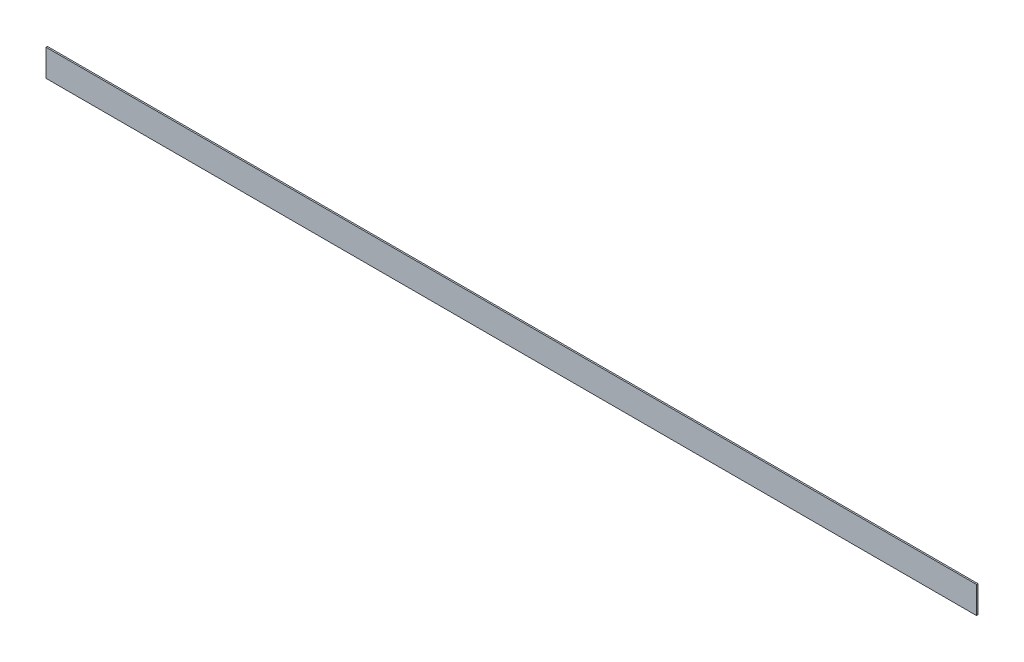
ISO-10303-21;
HEADER;
FILE_DESCRIPTION(('STEP AP214'),'2;1');
FILE_NAME('part.step','',(''),(''),'','','');
FILE_SCHEMA(('AUTOMOTIVE_DESIGN { 1 0 10303 214 1 1 1 1 }'));
ENDSEC;
DATA;
#1=APPLICATION_CONTEXT('core data for automotive mechanical design processes');
#2=APPLICATION_PROTOCOL_DEFINITION('international standard','automotive_design',2000,#1);
#3=PRODUCT_CONTEXT('',#1,'mechanical');
#4=PRODUCT('Part','Part','',(#3));
#5=PRODUCT_RELATED_PRODUCT_CATEGORY('part','',(#4));
#6=PRODUCT_DEFINITION_FORMATION('','',#4);
#7=PRODUCT_DEFINITION_CONTEXT('part definition',#1,'design');
#8=PRODUCT_DEFINITION('design','',#6,#7);
#9=PRODUCT_DEFINITION_SHAPE('','',#8);
#10=(LENGTH_UNIT() NAMED_UNIT(*) SI_UNIT(.MILLI.,.METRE.));
#11=(NAMED_UNIT(*) PLANE_ANGLE_UNIT() SI_UNIT($,.RADIAN.));
#12=(NAMED_UNIT(*) SI_UNIT($,.STERADIAN.) SOLID_ANGLE_UNIT());
#13=UNCERTAINTY_MEASURE_WITH_UNIT(LENGTH_MEASURE(1.E-05),#10,'distance_accuracy_value','');
#14=(GEOMETRIC_REPRESENTATION_CONTEXT(3) GLOBAL_UNCERTAINTY_ASSIGNED_CONTEXT((#13)) GLOBAL_UNIT_ASSIGNED_CONTEXT((#10,
#11,#12)) REPRESENTATION_CONTEXT('',''));
#15=CARTESIAN_POINT('',(0.,0.,0.));
#16=DIRECTION('',(0.,0.,1.));
#17=DIRECTION('',(1.,0.,0.));
#18=AXIS2_PLACEMENT_3D('',#15,#16,#17);
#19=CARTESIAN_POINT('',(0.,0.,25.4));
#20=DIRECTION('',(1.,0.,0.));
#21=DIRECTION('',(0.,1.,0.));
#22=AXIS2_PLACEMENT_3D('',#19,#20,#21);
#23=PLANE('',#22);
#24=DIRECTION('',(0.,-1.,0.));
#25=VECTOR('',#24,1.);
#26=CARTESIAN_POINT('',(0.,0.,0.));
#27=LINE('',#26,#25);
#28=CARTESIAN_POINT('',(0.,0.,0.));
#29=VERTEX_POINT('',#28);
#30=CARTESIAN_POINT('',(0.,-480.,0.));
#31=VERTEX_POINT('',#30);
#32=EDGE_CURVE('E111',#29,#31,#27,.T.);
#33=ORIENTED_EDGE('',*,*,#32,.T.);
#34=DIRECTION('',(0.,0.,-1.));
#35=VECTOR('',#34,1.);
#36=CARTESIAN_POINT('',(0.,-480.,25.4));
#37=LINE('',#36,#35);
#38=CARTESIAN_POINT('',(0.,-480.,25.4));
#39=VERTEX_POINT('',#38);
#40=EDGE_CURVE('E11',#39,#31,#37,.T.);
#41=ORIENTED_EDGE('',*,*,#40,.F.);
#42=DIRECTION('',(0.,-1.,0.));
#43=VECTOR('',#42,1.);
#44=CARTESIAN_POINT('',(0.,0.,25.4));
#45=LINE('',#44,#43);
#46=CARTESIAN_POINT('',(0.,0.,25.4));
#47=VERTEX_POINT('',#46);
#48=EDGE_CURVE('E95',#47,#39,#45,.T.);
#49=ORIENTED_EDGE('',*,*,#48,.F.);
#50=DIRECTION('',(0.,0.,-1.));
#51=VECTOR('',#50,1.);
#52=CARTESIAN_POINT('',(0.,0.,25.4));
#53=LINE('',#52,#51);
#54=EDGE_CURVE('E107',#47,#29,#53,.T.);
#55=ORIENTED_EDGE('',*,*,#54,.T.);
#56=EDGE_LOOP('',(#33,#41,#49,#55));
#57=FACE_BOUND('',#56,.T.);
#58=ADVANCED_FACE('F43',(#57),#23,.F.);
#59=CARTESIAN_POINT('',(0.,-480.,25.4));
#60=DIRECTION('',(0.,1.,0.));
#61=DIRECTION('',(0.,0.,1.));
#62=AXIS2_PLACEMENT_3D('',#59,#60,#61);
#63=PLANE('',#62);
#64=DIRECTION('',(1.,0.,0.));
#65=VECTOR('',#64,1.);
#66=CARTESIAN_POINT('',(0.,-480.,0.));
#67=LINE('',#66,#65);
#68=CARTESIAN_POINT('',(16560.8,-480.,0.));
#69=VERTEX_POINT('',#68);
#70=EDGE_CURVE('E100',#31,#69,#67,.T.);
#71=ORIENTED_EDGE('',*,*,#70,.T.);
#72=DIRECTION('',(0.,0.,-1.));
#73=VECTOR('',#72,1.);
#74=CARTESIAN_POINT('',(16560.8,-480.,25.4));
#75=LINE('',#74,#73);
#76=CARTESIAN_POINT('',(16560.8,-480.,25.4));
#77=VERTEX_POINT('',#76);
#78=EDGE_CURVE('E52',#77,#69,#75,.T.);
#79=ORIENTED_EDGE('',*,*,#78,.F.);
#80=DIRECTION('',(1.,0.,0.));
#81=VECTOR('',#80,1.);
#82=CARTESIAN_POINT('',(0.,-480.,25.4));
#83=LINE('',#82,#81);
#84=EDGE_CURVE('E90',#39,#77,#83,.T.);
#85=ORIENTED_EDGE('',*,*,#84,.F.);
#86=ORIENTED_EDGE('',*,*,#40,.T.);
#87=EDGE_LOOP('',(#71,#79,#85,#86));
#88=FACE_BOUND('',#87,.T.);
#89=ADVANCED_FACE('F99',(#88),#63,.F.);
#90=CARTESIAN_POINT('',(16560.8,0.,25.4));
#91=DIRECTION('',(-1.,0.,0.));
#92=DIRECTION('',(0.,0.,1.));
#93=AXIS2_PLACEMENT_3D('',#90,#91,#92);
#94=PLANE('',#93);
#95=DIRECTION('',(0.,1.,0.));
#96=VECTOR('',#95,1.);
#97=CARTESIAN_POINT('',(16560.8,0.,0.));
#98=LINE('',#97,#96);
#99=CARTESIAN_POINT('',(16560.8,0.,0.));
#100=VERTEX_POINT('',#99);
#101=EDGE_CURVE('E77',#69,#100,#98,.T.);
#102=ORIENTED_EDGE('',*,*,#101,.T.);
#103=DIRECTION('',(0.,0.,-1.));
#104=VECTOR('',#103,1.);
#105=CARTESIAN_POINT('',(16560.8,0.,25.4));
#106=LINE('',#105,#104);
#107=CARTESIAN_POINT('',(16560.8,0.,25.4));
#108=VERTEX_POINT('',#107);
#109=EDGE_CURVE('E102',#108,#100,#106,.T.);
#110=ORIENTED_EDGE('',*,*,#109,.F.);
#111=DIRECTION('',(0.,1.,0.));
#112=VECTOR('',#111,1.);
#113=CARTESIAN_POINT('',(16560.8,0.,25.4));
#114=LINE('',#113,#112);
#115=EDGE_CURVE('E93',#77,#108,#114,.T.);
#116=ORIENTED_EDGE('',*,*,#115,.F.);
#117=ORIENTED_EDGE('',*,*,#78,.T.);
#118=EDGE_LOOP('',(#102,#110,#116,#117));
#119=FACE_BOUND('',#118,.T.);
#120=ADVANCED_FACE('F103',(#119),#94,.F.);
#121=CARTESIAN_POINT('',(0.,0.,25.4));
#122=DIRECTION('',(0.,-1.,0.));
#123=DIRECTION('',(0.,0.,-1.));
#124=AXIS2_PLACEMENT_3D('',#121,#122,#123);
#125=PLANE('',#124);
#126=DIRECTION('',(-1.,0.,0.));
#127=VECTOR('',#126,1.);
#128=CARTESIAN_POINT('',(0.,0.,0.));
#129=LINE('',#128,#127);
#130=EDGE_CURVE('E83',#100,#29,#129,.T.);
#131=ORIENTED_EDGE('',*,*,#130,.T.);
#132=ORIENTED_EDGE('',*,*,#54,.F.);
#133=DIRECTION('',(-1.,0.,0.));
#134=VECTOR('',#133,1.);
#135=CARTESIAN_POINT('',(0.,0.,25.4));
#136=LINE('',#135,#134);
#137=EDGE_CURVE('E60',#108,#47,#136,.T.);
#138=ORIENTED_EDGE('',*,*,#137,.F.);
#139=ORIENTED_EDGE('',*,*,#109,.T.);
#140=EDGE_LOOP('',(#131,#132,#138,#139));
#141=FACE_BOUND('',#140,.T.);
#142=ADVANCED_FACE('F124',(#141),#125,.F.);
#143=CARTESIAN_POINT('',(0.,0.,25.4));
#144=DIRECTION('',(0.,0.,1.));
#145=DIRECTION('',(1.,0.,0.));
#146=AXIS2_PLACEMENT_3D('',#143,#144,#145);
#147=PLANE('',#146);
#148=ORIENTED_EDGE('',*,*,#48,.T.);
#149=ORIENTED_EDGE('',*,*,#84,.T.);
#150=ORIENTED_EDGE('',*,*,#115,.T.);
#151=ORIENTED_EDGE('',*,*,#137,.T.);
#152=EDGE_LOOP('',(#148,#149,#150,#151));
#153=FACE_BOUND('',#152,.T.);
#154=ADVANCED_FACE('F91',(#153),#147,.T.);
#155=CARTESIAN_POINT('',(0.,0.,0.));
#156=DIRECTION('',(0.,0.,1.));
#157=DIRECTION('',(1.,0.,0.));
#158=AXIS2_PLACEMENT_3D('',#155,#156,#157);
#159=PLANE('',#158);
#160=ORIENTED_EDGE('',*,*,#32,.F.);
#161=ORIENTED_EDGE('',*,*,#130,.F.);
#162=ORIENTED_EDGE('',*,*,#101,.F.);
#163=ORIENTED_EDGE('',*,*,#70,.F.);
#164=EDGE_LOOP('',(#160,#161,#162,#163));
#165=FACE_BOUND('',#164,.T.);
#166=ADVANCED_FACE('F127',(#165),#159,.F.);
#167=CLOSED_SHELL('',(#58,#89,#120,#142,#154,#166));
#168=MANIFOLD_SOLID_BREP('B2',#167);
#169=ADVANCED_BREP_SHAPE_REPRESENTATION('',(#18,#168),#14);
#170=SHAPE_DEFINITION_REPRESENTATION(#9,#169);
ENDSEC;
END-ISO-10303-21;
